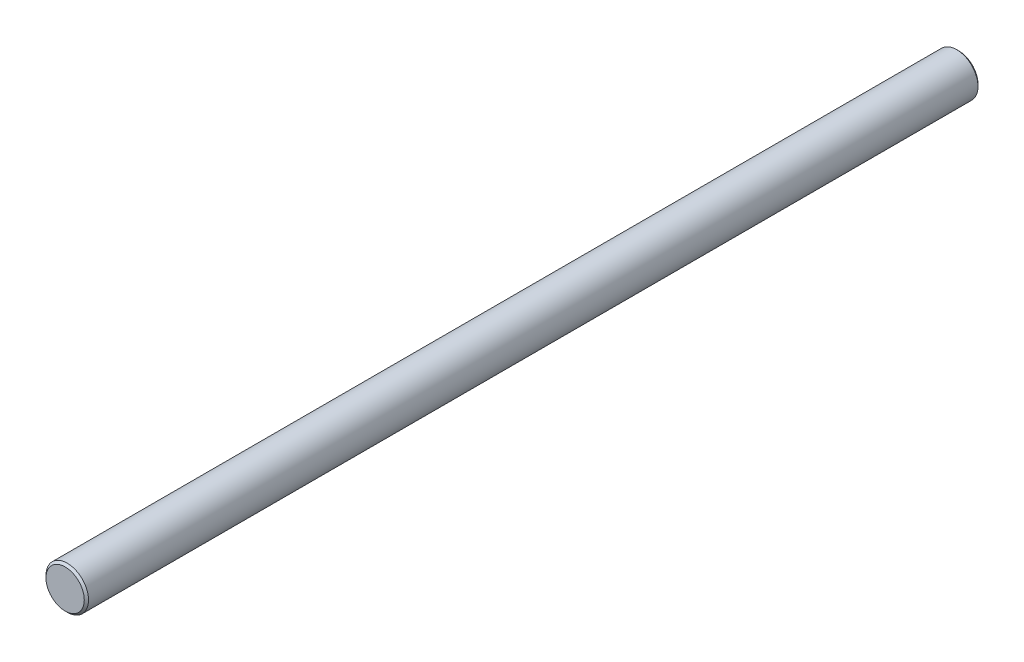
ISO-10303-21;
HEADER;
FILE_DESCRIPTION(('STEP AP214'),'2;1');
FILE_NAME('part.step','',(''),(''),'','','');
FILE_SCHEMA(('AUTOMOTIVE_DESIGN { 1 0 10303 214 1 1 1 1 }'));
ENDSEC;
DATA;
#1=APPLICATION_CONTEXT('core data for automotive mechanical design processes');
#2=APPLICATION_PROTOCOL_DEFINITION('international standard','automotive_design',2000,#1);
#3=PRODUCT_CONTEXT('',#1,'mechanical');
#4=PRODUCT('Part','Part','',(#3));
#5=PRODUCT_RELATED_PRODUCT_CATEGORY('part','',(#4));
#6=PRODUCT_DEFINITION_FORMATION('','',#4);
#7=PRODUCT_DEFINITION_CONTEXT('part definition',#1,'design');
#8=PRODUCT_DEFINITION('design','',#6,#7);
#9=PRODUCT_DEFINITION_SHAPE('','',#8);
#10=(LENGTH_UNIT() NAMED_UNIT(*) SI_UNIT(.MILLI.,.METRE.));
#11=(NAMED_UNIT(*) PLANE_ANGLE_UNIT() SI_UNIT($,.RADIAN.));
#12=(NAMED_UNIT(*) SI_UNIT($,.STERADIAN.) SOLID_ANGLE_UNIT());
#13=UNCERTAINTY_MEASURE_WITH_UNIT(LENGTH_MEASURE(1.E-05),#10,'distance_accuracy_value','');
#14=(GEOMETRIC_REPRESENTATION_CONTEXT(3) GLOBAL_UNCERTAINTY_ASSIGNED_CONTEXT((#13)) GLOBAL_UNIT_ASSIGNED_CONTEXT((#10,
#11,#12)) REPRESENTATION_CONTEXT('',''));
#15=CARTESIAN_POINT('',(0.,0.,0.));
#16=DIRECTION('',(0.,0.,1.));
#17=DIRECTION('',(1.,0.,0.));
#18=AXIS2_PLACEMENT_3D('',#15,#16,#17);
#19=CARTESIAN_POINT('',(0.,0.,-210.));
#20=DIRECTION('',(0.,0.,1.));
#21=DIRECTION('',(1.,0.,0.));
#22=AXIS2_PLACEMENT_3D('',#19,#20,#21);
#23=CYLINDRICAL_SURFACE('',#22,5.);
#24=CARTESIAN_POINT('',(0.,0.,-209.5));
#25=DIRECTION('',(0.,0.,1.));
#26=DIRECTION('',(1.,0.,0.));
#27=AXIS2_PLACEMENT_3D('',#24,#25,#26);
#28=CIRCLE('',#27,5.);
#29=CARTESIAN_POINT('',(5.,0.,-209.5));
#30=VERTEX_POINT('',#29);
#31=EDGE_CURVE('E46',#30,#30,#28,.T.);
#32=ORIENTED_EDGE('',*,*,#31,.T.);
#33=EDGE_LOOP('',(#32));
#34=FACE_BOUND('',#33,.T.);
#35=CARTESIAN_POINT('',(0.,0.,-0.5));
#36=DIRECTION('',(0.,0.,1.));
#37=DIRECTION('',(1.,0.,0.));
#38=AXIS2_PLACEMENT_3D('',#35,#36,#37);
#39=CIRCLE('',#38,5.);
#40=CARTESIAN_POINT('',(5.,0.,-0.5));
#41=VERTEX_POINT('',#40);
#42=EDGE_CURVE('E50',#41,#41,#39,.F.);
#43=ORIENTED_EDGE('',*,*,#42,.T.);
#44=EDGE_LOOP('',(#43));
#45=FACE_BOUND('',#44,.T.);
#46=ADVANCED_FACE('F35',(#34,#45),#23,.T.);
#47=CARTESIAN_POINT('',(0.,0.,-210.));
#48=DIRECTION('',(0.,0.,1.));
#49=DIRECTION('',(1.,0.,0.));
#50=AXIS2_PLACEMENT_3D('',#47,#48,#49);
#51=PLANE('',#50);
#52=CARTESIAN_POINT('',(0.,0.,-210.));
#53=DIRECTION('',(0.,0.,1.));
#54=DIRECTION('',(1.,0.,0.));
#55=AXIS2_PLACEMENT_3D('',#52,#53,#54);
#56=CIRCLE('',#55,4.5);
#57=CARTESIAN_POINT('',(4.5,0.,-210.));
#58=VERTEX_POINT('',#57);
#59=EDGE_CURVE('E42',#58,#58,#56,.F.);
#60=ORIENTED_EDGE('',*,*,#59,.T.);
#61=EDGE_LOOP('',(#60));
#62=FACE_BOUND('',#61,.T.);
#63=ADVANCED_FACE('F66',(#62),#51,.F.);
#64=CARTESIAN_POINT('',(0.,0.,0.));
#65=DIRECTION('',(0.,0.,1.));
#66=DIRECTION('',(1.,0.,0.));
#67=AXIS2_PLACEMENT_3D('',#64,#65,#66);
#68=PLANE('',#67);
#69=CARTESIAN_POINT('',(0.,0.,0.));
#70=DIRECTION('',(0.,0.,1.));
#71=DIRECTION('',(1.,0.,0.));
#72=AXIS2_PLACEMENT_3D('',#69,#70,#71);
#73=CIRCLE('',#72,4.5);
#74=CARTESIAN_POINT('',(4.5,0.,0.));
#75=VERTEX_POINT('',#74);
#76=EDGE_CURVE('E10',#75,#75,#73,.T.);
#77=ORIENTED_EDGE('',*,*,#76,.T.);
#78=EDGE_LOOP('',(#77));
#79=FACE_BOUND('',#78,.T.);
#80=ADVANCED_FACE('F63',(#79),#68,.T.);
#81=CARTESIAN_POINT('',(0.,0.,-209.5));
#82=DIRECTION('',(0.,0.,1.));
#83=DIRECTION('',(1.,0.,0.));
#84=AXIS2_PLACEMENT_3D('',#81,#82,#83);
#85=CONICAL_SURFACE('',#84,5.,0.785398163397472);
#86=ORIENTED_EDGE('',*,*,#59,.F.);
#87=EDGE_LOOP('',(#86));
#88=FACE_BOUND('',#87,.T.);
#89=ORIENTED_EDGE('',*,*,#31,.F.);
#90=EDGE_LOOP('',(#89));
#91=FACE_BOUND('',#90,.T.);
#92=ADVANCED_FACE('F59',(#88,#91),#85,.T.);
#93=CARTESIAN_POINT('',(0.,0.,0.));
#94=DIRECTION('',(0.,0.,-1.));
#95=DIRECTION('',(-1.,0.,0.));
#96=AXIS2_PLACEMENT_3D('',#93,#94,#95);
#97=CONICAL_SURFACE('',#96,4.5,0.785398163397444);
#98=ORIENTED_EDGE('',*,*,#42,.F.);
#99=EDGE_LOOP('',(#98));
#100=FACE_BOUND('',#99,.T.);
#101=ORIENTED_EDGE('',*,*,#76,.F.);
#102=EDGE_LOOP('',(#101));
#103=FACE_BOUND('',#102,.T.);
#104=ADVANCED_FACE('F37',(#100,#103),#97,.T.);
#105=CLOSED_SHELL('',(#46,#63,#80,#92,#104));
#106=MANIFOLD_SOLID_BREP('B2',#105);
#107=ADVANCED_BREP_SHAPE_REPRESENTATION('',(#18,#106),#14);
#108=SHAPE_DEFINITION_REPRESENTATION(#9,#107);
ENDSEC;
END-ISO-10303-21;
